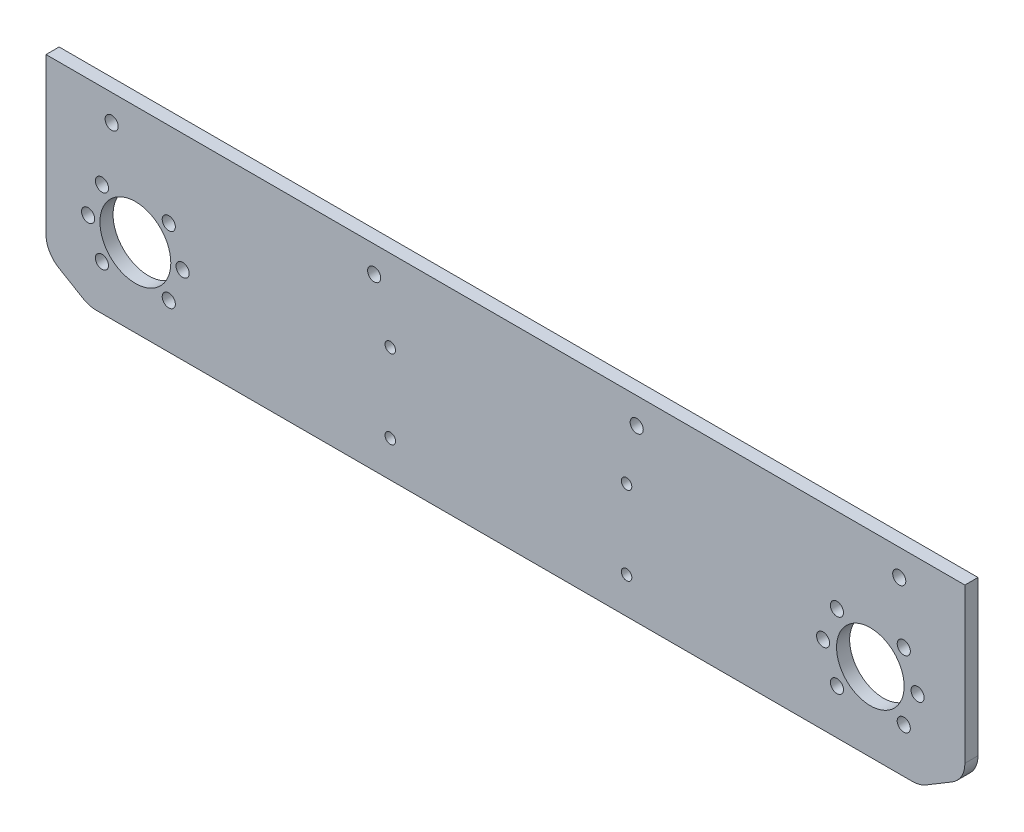
ISO-10303-21;
HEADER;
FILE_DESCRIPTION(('STEP AP214'),'2;1');
FILE_NAME('part.step','',(''),(''),'','','');
FILE_SCHEMA(('AUTOMOTIVE_DESIGN { 1 0 10303 214 1 1 1 1 }'));
ENDSEC;
DATA;
#1=APPLICATION_CONTEXT('core data for automotive mechanical design processes');
#2=APPLICATION_PROTOCOL_DEFINITION('international standard','automotive_design',2000,#1);
#3=PRODUCT_CONTEXT('',#1,'mechanical');
#4=PRODUCT('Part','Part','',(#3));
#5=PRODUCT_RELATED_PRODUCT_CATEGORY('part','',(#4));
#6=PRODUCT_DEFINITION_FORMATION('','',#4);
#7=PRODUCT_DEFINITION_CONTEXT('part definition',#1,'design');
#8=PRODUCT_DEFINITION('design','',#6,#7);
#9=PRODUCT_DEFINITION_SHAPE('','',#8);
#10=(LENGTH_UNIT() NAMED_UNIT(*) SI_UNIT(.MILLI.,.METRE.));
#11=(NAMED_UNIT(*) PLANE_ANGLE_UNIT() SI_UNIT($,.RADIAN.));
#12=(NAMED_UNIT(*) SI_UNIT($,.STERADIAN.) SOLID_ANGLE_UNIT());
#13=UNCERTAINTY_MEASURE_WITH_UNIT(LENGTH_MEASURE(1.E-05),#10,'distance_accuracy_value','');
#14=(GEOMETRIC_REPRESENTATION_CONTEXT(3) GLOBAL_UNCERTAINTY_ASSIGNED_CONTEXT((#13)) GLOBAL_UNIT_ASSIGNED_CONTEXT((#10,
#11,#12)) REPRESENTATION_CONTEXT('',''));
#15=CARTESIAN_POINT('',(0.,0.,0.));
#16=DIRECTION('',(0.,0.,1.));
#17=DIRECTION('',(1.,0.,0.));
#18=AXIS2_PLACEMENT_3D('',#15,#16,#17);
#19=CARTESIAN_POINT('',(-167.402767174734,-12.7734326703558,5.));
#20=DIRECTION('',(0.,0.,-1.));
#21=DIRECTION('',(-1.,0.,0.));
#22=AXIS2_PLACEMENT_3D('',#19,#20,#21);
#23=PLANE('',#22);
#24=DIRECTION('',(0.,1.,0.));
#25=VECTOR('',#24,1.);
#26=CARTESIAN_POINT('',(172.597232825266,-12.2122551122481,5.));
#27=LINE('',#26,#25);
#28=CARTESIAN_POINT('',(172.597232825266,-12.2122551122481,5.));
#29=VERTEX_POINT('',#28);
#30=CARTESIAN_POINT('',(172.597232825266,46.5972328252662,5.));
#31=VERTEX_POINT('',#30);
#32=EDGE_CURVE('E98',#29,#31,#27,.T.);
#33=ORIENTED_EDGE('',*,*,#32,.T.);
#34=DIRECTION('',(-1.,0.,0.));
#35=VECTOR('',#34,1.);
#36=CARTESIAN_POINT('',(-177.402767174734,46.5972328252662,5.));
#37=LINE('',#36,#35);
#38=CARTESIAN_POINT('',(-177.402767174734,46.5972328252662,5.));
#39=VERTEX_POINT('',#38);
#40=EDGE_CURVE('E186',#31,#39,#37,.T.);
#41=ORIENTED_EDGE('',*,*,#40,.T.);
#42=DIRECTION('',(0.,-1.,0.));
#43=VECTOR('',#42,1.);
#44=CARTESIAN_POINT('',(-177.402767174734,46.5972328252662,5.));
#45=LINE('',#44,#43);
#46=CARTESIAN_POINT('',(-177.402767174734,-12.7734326703558,5.));
#47=VERTEX_POINT('',#46);
#48=EDGE_CURVE('E182',#39,#47,#45,.T.);
#49=ORIENTED_EDGE('',*,*,#48,.T.);
#50=CARTESIAN_POINT('',(-167.402767174734,-12.7734326703558,5.));
#51=DIRECTION('',(0.,0.,1.));
#52=DIRECTION('',(-1.,0.,0.));
#53=AXIS2_PLACEMENT_3D('',#50,#51,#52);
#54=CIRCLE('',#53,10.);
#55=CARTESIAN_POINT('',(-172.485413259546,-21.3854422370334,5.));
#56=VERTEX_POINT('',#55);
#57=EDGE_CURVE('E203',#47,#56,#54,.T.);
#58=ORIENTED_EDGE('',*,*,#57,.T.);
#59=DIRECTION('',(0.861200956667754,-0.508264608481198,0.));
#60=VECTOR('',#59,1.);
#61=CARTESIAN_POINT('',(-172.485413259546,-21.3854422370334,5.));
#62=LINE('',#61,#60);
#63=CARTESIAN_POINT('',(-163.287395186087,-26.8139395218003,5.));
#64=VERTEX_POINT('',#63);
#65=EDGE_CURVE('E200',#56,#64,#62,.T.);
#66=ORIENTED_EDGE('',*,*,#65,.T.);
#67=CARTESIAN_POINT('',(-158.204749101275,-18.2019299551227,5.));
#68=DIRECTION('',(0.,0.,1.));
#69=DIRECTION('',(1.,0.,0.));
#70=AXIS2_PLACEMENT_3D('',#67,#68,#69);
#71=CIRCLE('',#70,10.);
#72=CARTESIAN_POINT('',(-158.204749101275,-28.2019299551228,5.));
#73=VERTEX_POINT('',#72);
#74=EDGE_CURVE('E202',#64,#73,#71,.T.);
#75=ORIENTED_EDGE('',*,*,#74,.T.);
#76=DIRECTION('',(1.,0.,0.));
#77=VECTOR('',#76,1.);
#78=CARTESIAN_POINT('',(-158.204749101275,-28.2019299551227,5.));
#79=LINE('',#78,#77);
#80=CARTESIAN_POINT('',(152.619810176667,-28.2019299551227,5.));
#81=VERTEX_POINT('',#80);
#82=EDGE_CURVE('E124',#73,#81,#79,.T.);
#83=ORIENTED_EDGE('',*,*,#82,.T.);
#84=CARTESIAN_POINT('',(152.619810176667,-18.2019299551227,5.));
#85=DIRECTION('',(0.,0.,1.));
#86=DIRECTION('',(-1.,0.,0.));
#87=AXIS2_PLACEMENT_3D('',#84,#85,#86);
#88=CIRCLE('',#87,10.);
#89=CARTESIAN_POINT('',(157.766802923038,-26.775637768479,5.));
#90=VERTEX_POINT('',#89);
#91=EDGE_CURVE('E118',#81,#90,#88,.T.);
#92=ORIENTED_EDGE('',*,*,#91,.T.);
#93=DIRECTION('',(0.857370781335623,0.514699274637087,0.));
#94=VECTOR('',#93,1.);
#95=CARTESIAN_POINT('',(157.766802923038,-26.775637768479,5.));
#96=LINE('',#95,#94);
#97=CARTESIAN_POINT('',(167.744225571637,-20.7859629256043,5.));
#98=VERTEX_POINT('',#97);
#99=EDGE_CURVE('E122',#90,#98,#96,.T.);
#100=ORIENTED_EDGE('',*,*,#99,.T.);
#101=CARTESIAN_POINT('',(162.597232825266,-12.2122551122481,5.));
#102=DIRECTION('',(0.,0.,1.));
#103=DIRECTION('',(1.,0.,0.));
#104=AXIS2_PLACEMENT_3D('',#101,#102,#103);
#105=CIRCLE('',#104,10.);
#106=EDGE_CURVE('E50',#98,#29,#105,.T.);
#107=ORIENTED_EDGE('',*,*,#106,.T.);
#108=EDGE_LOOP('',(#33,#41,#49,#58,#66,#75,#83,#92,#100,#107));
#109=FACE_BOUND('',#108,.T.);
#110=CARTESIAN_POINT('',(-46.2689939647074,15.5907548810993,5.));
#111=DIRECTION('',(0.,0.,1.));
#112=DIRECTION('',(1.,0.,0.));
#113=AXIS2_PLACEMENT_3D('',#110,#111,#112);
#114=CIRCLE('',#113,2.00000000000001);
#115=CARTESIAN_POINT('',(-44.2689939647074,15.5907548810993,5.));
#116=VERTEX_POINT('',#115);
#117=EDGE_CURVE('E144',#116,#116,#114,.T.);
#118=ORIENTED_EDGE('',*,*,#117,.F.);
#119=EDGE_LOOP('',(#118));
#120=FACE_BOUND('',#119,.T.);
#121=CARTESIAN_POINT('',(118.590211239185,1.63605856800766,5.));
#122=DIRECTION('',(0.,0.,1.));
#123=DIRECTION('',(1.,0.,0.));
#124=AXIS2_PLACEMENT_3D('',#121,#122,#123);
#125=CIRCLE('',#124,2.5);
#126=CARTESIAN_POINT('',(121.090211239185,1.63605856800766,5.));
#127=VERTEX_POINT('',#126);
#128=EDGE_CURVE('E214',#127,#127,#125,.T.);
#129=ORIENTED_EDGE('',*,*,#128,.F.);
#130=EDGE_LOOP('',(#129));
#131=FACE_BOUND('',#130,.T.);
#132=CARTESIAN_POINT('',(154.590211239185,1.63605856800766,5.));
#133=DIRECTION('',(0.,0.,1.));
#134=DIRECTION('',(1.,0.,0.));
#135=AXIS2_PLACEMENT_3D('',#132,#133,#134);
#136=CIRCLE('',#135,2.5);
#137=CARTESIAN_POINT('',(157.090211239185,1.63605856800766,5.));
#138=VERTEX_POINT('',#137);
#139=EDGE_CURVE('E220',#138,#138,#136,.T.);
#140=ORIENTED_EDGE('',*,*,#139,.F.);
#141=EDGE_LOOP('',(#140));
#142=FACE_BOUND('',#141,.T.);
#143=CARTESIAN_POINT('',(136.590211239185,1.63605856800766,5.));
#144=DIRECTION('',(0.,0.,1.));
#145=DIRECTION('',(1.,0.,0.));
#146=AXIS2_PLACEMENT_3D('',#143,#144,#145);
#147=CIRCLE('',#146,12.875);
#148=CARTESIAN_POINT('',(149.465211239185,1.63605856800766,5.));
#149=VERTEX_POINT('',#148);
#150=EDGE_CURVE('E226',#149,#149,#147,.T.);
#151=ORIENTED_EDGE('',*,*,#150,.F.);
#152=EDGE_LOOP('',(#151));
#153=FACE_BOUND('',#152,.T.);
#154=CARTESIAN_POINT('',(-143.364629919046,1.61614445701794,5.));
#155=DIRECTION('',(0.,0.,1.));
#156=DIRECTION('',(1.,0.,0.));
#157=AXIS2_PLACEMENT_3D('',#154,#155,#156);
#158=CIRCLE('',#157,13.5);
#159=CARTESIAN_POINT('',(-129.864629919046,1.61614445701794,5.));
#160=VERTEX_POINT('',#159);
#161=EDGE_CURVE('E232',#160,#160,#158,.T.);
#162=ORIENTED_EDGE('',*,*,#161,.F.);
#163=EDGE_LOOP('',(#162));
#164=FACE_BOUND('',#163,.T.);
#165=CARTESIAN_POINT('',(-130.636707857688,14.3440665183758,5.));
#166=DIRECTION('',(0.,0.,1.));
#167=DIRECTION('',(1.,0.,0.));
#168=AXIS2_PLACEMENT_3D('',#165,#166,#167);
#169=CIRCLE('',#168,2.5);
#170=CARTESIAN_POINT('',(-128.136707857688,14.3440665183758,5.));
#171=VERTEX_POINT('',#170);
#172=EDGE_CURVE('E238',#171,#171,#169,.T.);
#173=ORIENTED_EDGE('',*,*,#172,.F.);
#174=EDGE_LOOP('',(#173));
#175=FACE_BOUND('',#174,.T.);
#176=CARTESIAN_POINT('',(-156.092551980404,14.3440665183758,5.));
#177=DIRECTION('',(0.,0.,1.));
#178=DIRECTION('',(-1.,0.,0.));
#179=AXIS2_PLACEMENT_3D('',#176,#177,#178);
#180=CIRCLE('',#179,2.5);
#181=CARTESIAN_POINT('',(-158.592551980404,14.3440665183758,5.));
#182=VERTEX_POINT('',#181);
#183=EDGE_CURVE('E244',#182,#182,#180,.T.);
#184=ORIENTED_EDGE('',*,*,#183,.F.);
#185=EDGE_LOOP('',(#184));
#186=FACE_BOUND('',#185,.T.);
#187=CARTESIAN_POINT('',(-130.636707857688,-11.1117776043399,5.));
#188=DIRECTION('',(0.,0.,1.));
#189=DIRECTION('',(-1.,0.,0.));
#190=AXIS2_PLACEMENT_3D('',#187,#188,#189);
#191=CIRCLE('',#190,2.5);
#192=CARTESIAN_POINT('',(-133.136707857688,-11.1117776043399,5.));
#193=VERTEX_POINT('',#192);
#194=EDGE_CURVE('E250',#193,#193,#191,.T.);
#195=ORIENTED_EDGE('',*,*,#194,.F.);
#196=EDGE_LOOP('',(#195));
#197=FACE_BOUND('',#196,.T.);
#198=CARTESIAN_POINT('',(-156.092551980404,-11.1117776043399,5.));
#199=DIRECTION('',(0.,0.,1.));
#200=DIRECTION('',(1.,0.,0.));
#201=AXIS2_PLACEMENT_3D('',#198,#199,#200);
#202=CIRCLE('',#201,2.5);
#203=CARTESIAN_POINT('',(-153.592551980404,-11.1117776043399,5.));
#204=VERTEX_POINT('',#203);
#205=EDGE_CURVE('E256',#204,#204,#202,.T.);
#206=ORIENTED_EDGE('',*,*,#205,.F.);
#207=EDGE_LOOP('',(#206));
#208=FACE_BOUND('',#207,.T.);
#209=CARTESIAN_POINT('',(-46.2689939647074,-14.4092451189008,5.));
#210=DIRECTION('',(0.,0.,1.));
#211=DIRECTION('',(1.,0.,0.));
#212=AXIS2_PLACEMENT_3D('',#209,#210,#211);
#213=CIRCLE('',#212,2.00000000000001);
#214=CARTESIAN_POINT('',(-44.2689939647074,-14.4092451189008,5.));
#215=VERTEX_POINT('',#214);
#216=EDGE_CURVE('E262',#215,#215,#213,.T.);
#217=ORIENTED_EDGE('',*,*,#216,.F.);
#218=EDGE_LOOP('',(#217));
#219=FACE_BOUND('',#218,.T.);
#220=CARTESIAN_POINT('',(43.7374372852343,15.5907548810993,5.));
#221=DIRECTION('',(0.,0.,1.));
#222=DIRECTION('',(1.,0.,0.));
#223=AXIS2_PLACEMENT_3D('',#220,#221,#222);
#224=CIRCLE('',#223,2.);
#225=CARTESIAN_POINT('',(45.7374372852343,15.5907548810993,5.));
#226=VERTEX_POINT('',#225);
#227=EDGE_CURVE('E268',#226,#226,#224,.T.);
#228=ORIENTED_EDGE('',*,*,#227,.F.);
#229=EDGE_LOOP('',(#228));
#230=FACE_BOUND('',#229,.T.);
#231=CARTESIAN_POINT('',(43.7374372852343,-14.4092451189008,5.));
#232=DIRECTION('',(0.,0.,1.));
#233=DIRECTION('',(1.,0.,0.));
#234=AXIS2_PLACEMENT_3D('',#231,#232,#233);
#235=CIRCLE('',#234,2.);
#236=CARTESIAN_POINT('',(45.7374372852343,-14.4092451189008,5.));
#237=VERTEX_POINT('',#236);
#238=EDGE_CURVE('E274',#237,#237,#235,.T.);
#239=ORIENTED_EDGE('',*,*,#238,.F.);
#240=EDGE_LOOP('',(#239));
#241=FACE_BOUND('',#240,.T.);
#242=CARTESIAN_POINT('',(-152.402767174734,36.5972328252662,5.));
#243=DIRECTION('',(0.,0.,1.));
#244=DIRECTION('',(1.,0.,0.));
#245=AXIS2_PLACEMENT_3D('',#242,#243,#244);
#246=CIRCLE('',#245,2.5);
#247=CARTESIAN_POINT('',(-149.902767174734,36.5972328252662,5.));
#248=VERTEX_POINT('',#247);
#249=EDGE_CURVE('E280',#248,#248,#246,.T.);
#250=ORIENTED_EDGE('',*,*,#249,.F.);
#251=EDGE_LOOP('',(#250));
#252=FACE_BOUND('',#251,.T.);
#253=CARTESIAN_POINT('',(-52.4027671747336,36.5972328252662,5.));
#254=DIRECTION('',(0.,0.,1.));
#255=DIRECTION('',(1.,0.,0.));
#256=AXIS2_PLACEMENT_3D('',#253,#254,#255);
#257=CIRCLE('',#256,2.5);
#258=CARTESIAN_POINT('',(-49.9027671747336,36.5972328252662,5.));
#259=VERTEX_POINT('',#258);
#260=EDGE_CURVE('E286',#259,#259,#257,.T.);
#261=ORIENTED_EDGE('',*,*,#260,.F.);
#262=EDGE_LOOP('',(#261));
#263=FACE_BOUND('',#262,.T.);
#264=CARTESIAN_POINT('',(47.5972328252664,36.5972328252662,5.));
#265=DIRECTION('',(0.,0.,1.));
#266=DIRECTION('',(1.,0.,0.));
#267=AXIS2_PLACEMENT_3D('',#264,#265,#266);
#268=CIRCLE('',#267,2.5);
#269=CARTESIAN_POINT('',(50.0972328252664,36.5972328252662,5.));
#270=VERTEX_POINT('',#269);
#271=EDGE_CURVE('E292',#270,#270,#268,.T.);
#272=ORIENTED_EDGE('',*,*,#271,.F.);
#273=EDGE_LOOP('',(#272));
#274=FACE_BOUND('',#273,.T.);
#275=CARTESIAN_POINT('',(147.597232825266,36.5972328252662,5.));
#276=DIRECTION('',(0.,0.,1.));
#277=DIRECTION('',(1.,0.,0.));
#278=AXIS2_PLACEMENT_3D('',#275,#276,#277);
#279=CIRCLE('',#278,2.5);
#280=CARTESIAN_POINT('',(150.097232825266,36.5972328252662,5.));
#281=VERTEX_POINT('',#280);
#282=EDGE_CURVE('E298',#281,#281,#279,.T.);
#283=ORIENTED_EDGE('',*,*,#282,.F.);
#284=EDGE_LOOP('',(#283));
#285=FACE_BOUND('',#284,.T.);
#286=CARTESIAN_POINT('',(-161.364629919046,1.61614445701794,5.));
#287=DIRECTION('',(0.,0.,1.));
#288=DIRECTION('',(1.,0.,0.));
#289=AXIS2_PLACEMENT_3D('',#286,#287,#288);
#290=CIRCLE('',#289,2.5);
#291=CARTESIAN_POINT('',(-158.864629919046,1.61614445701794,5.));
#292=VERTEX_POINT('',#291);
#293=EDGE_CURVE('E304',#292,#292,#290,.T.);
#294=ORIENTED_EDGE('',*,*,#293,.F.);
#295=EDGE_LOOP('',(#294));
#296=FACE_BOUND('',#295,.T.);
#297=CARTESIAN_POINT('',(-125.364629919046,1.61614445701794,5.));
#298=DIRECTION('',(0.,0.,1.));
#299=DIRECTION('',(-1.,0.,0.));
#300=AXIS2_PLACEMENT_3D('',#297,#298,#299);
#301=CIRCLE('',#300,2.5);
#302=CARTESIAN_POINT('',(-127.864629919046,1.61614445701794,5.));
#303=VERTEX_POINT('',#302);
#304=EDGE_CURVE('E310',#303,#303,#301,.T.);
#305=ORIENTED_EDGE('',*,*,#304,.F.);
#306=EDGE_LOOP('',(#305));
#307=FACE_BOUND('',#306,.T.);
#308=CARTESIAN_POINT('',(149.318133300543,-11.0918634933502,5.));
#309=DIRECTION('',(0.,0.,1.));
#310=DIRECTION('',(-1.,0.,0.));
#311=AXIS2_PLACEMENT_3D('',#308,#309,#310);
#312=CIRCLE('',#311,2.5);
#313=CARTESIAN_POINT('',(146.818133300543,-11.0918634933502,5.));
#314=VERTEX_POINT('',#313);
#315=EDGE_CURVE('E316',#314,#314,#312,.T.);
#316=ORIENTED_EDGE('',*,*,#315,.F.);
#317=EDGE_LOOP('',(#316));
#318=FACE_BOUND('',#317,.T.);
#319=CARTESIAN_POINT('',(123.862289177827,-11.0918634933502,5.));
#320=DIRECTION('',(0.,0.,1.));
#321=DIRECTION('',(1.,0.,0.));
#322=AXIS2_PLACEMENT_3D('',#319,#320,#321);
#323=CIRCLE('',#322,2.5);
#324=CARTESIAN_POINT('',(126.362289177827,-11.0918634933502,5.));
#325=VERTEX_POINT('',#324);
#326=EDGE_CURVE('E322',#325,#325,#323,.T.);
#327=ORIENTED_EDGE('',*,*,#326,.F.);
#328=EDGE_LOOP('',(#327));
#329=FACE_BOUND('',#328,.T.);
#330=CARTESIAN_POINT('',(123.862289177827,14.3639806293655,5.));
#331=DIRECTION('',(0.,0.,1.));
#332=DIRECTION('',(-1.,0.,0.));
#333=AXIS2_PLACEMENT_3D('',#330,#331,#332);
#334=CIRCLE('',#333,2.5);
#335=CARTESIAN_POINT('',(121.362289177827,14.3639806293655,5.));
#336=VERTEX_POINT('',#335);
#337=EDGE_CURVE('E328',#336,#336,#334,.T.);
#338=ORIENTED_EDGE('',*,*,#337,.F.);
#339=EDGE_LOOP('',(#338));
#340=FACE_BOUND('',#339,.T.);
#341=CARTESIAN_POINT('',(149.318133300543,14.3639806293655,5.));
#342=DIRECTION('',(0.,0.,1.));
#343=DIRECTION('',(1.,0.,0.));
#344=AXIS2_PLACEMENT_3D('',#341,#342,#343);
#345=CIRCLE('',#344,2.5);
#346=CARTESIAN_POINT('',(151.818133300543,14.3639806293655,5.));
#347=VERTEX_POINT('',#346);
#348=EDGE_CURVE('E334',#347,#347,#345,.T.);
#349=ORIENTED_EDGE('',*,*,#348,.F.);
#350=EDGE_LOOP('',(#349));
#351=FACE_BOUND('',#350,.T.);
#352=ADVANCED_FACE('F33',(#109,#120,#131,#142,#153,#164,#175,#186,#197,#208,#219,#230,#241,#252,
#263,#274,#285,#296,#307,#318,#329,#340,#351),#23,.F.);
#353=CARTESIAN_POINT('',(-167.402767174734,-12.7734326703558,0.));
#354=DIRECTION('',(0.,0.,-1.));
#355=DIRECTION('',(-1.,0.,0.));
#356=AXIS2_PLACEMENT_3D('',#353,#354,#355);
#357=PLANE('',#356);
#358=CARTESIAN_POINT('',(123.862289177827,14.3639806293655,0.));
#359=DIRECTION('',(0.,0.,1.));
#360=DIRECTION('',(-1.,0.,0.));
#361=AXIS2_PLACEMENT_3D('',#358,#359,#360);
#362=CIRCLE('',#361,2.5);
#363=CARTESIAN_POINT('',(121.362289177827,14.3639806293655,0.));
#364=VERTEX_POINT('',#363);
#365=EDGE_CURVE('E331',#364,#364,#362,.T.);
#366=ORIENTED_EDGE('',*,*,#365,.T.);
#367=EDGE_LOOP('',(#366));
#368=FACE_BOUND('',#367,.T.);
#369=CARTESIAN_POINT('',(149.318133300543,-11.0918634933502,0.));
#370=DIRECTION('',(0.,0.,1.));
#371=DIRECTION('',(-1.,0.,0.));
#372=AXIS2_PLACEMENT_3D('',#369,#370,#371);
#373=CIRCLE('',#372,2.5);
#374=CARTESIAN_POINT('',(146.818133300543,-11.0918634933502,0.));
#375=VERTEX_POINT('',#374);
#376=EDGE_CURVE('E319',#375,#375,#373,.T.);
#377=ORIENTED_EDGE('',*,*,#376,.T.);
#378=EDGE_LOOP('',(#377));
#379=FACE_BOUND('',#378,.T.);
#380=CARTESIAN_POINT('',(-161.364629919046,1.61614445701794,0.));
#381=DIRECTION('',(0.,0.,1.));
#382=DIRECTION('',(1.,0.,0.));
#383=AXIS2_PLACEMENT_3D('',#380,#381,#382);
#384=CIRCLE('',#383,2.5);
#385=CARTESIAN_POINT('',(-158.864629919046,1.61614445701794,0.));
#386=VERTEX_POINT('',#385);
#387=EDGE_CURVE('E307',#386,#386,#384,.T.);
#388=ORIENTED_EDGE('',*,*,#387,.T.);
#389=EDGE_LOOP('',(#388));
#390=FACE_BOUND('',#389,.T.);
#391=CARTESIAN_POINT('',(47.5972328252664,36.5972328252662,0.));
#392=DIRECTION('',(0.,0.,1.));
#393=DIRECTION('',(1.,0.,0.));
#394=AXIS2_PLACEMENT_3D('',#391,#392,#393);
#395=CIRCLE('',#394,2.5);
#396=CARTESIAN_POINT('',(50.0972328252664,36.5972328252662,0.));
#397=VERTEX_POINT('',#396);
#398=EDGE_CURVE('E295',#397,#397,#395,.T.);
#399=ORIENTED_EDGE('',*,*,#398,.T.);
#400=EDGE_LOOP('',(#399));
#401=FACE_BOUND('',#400,.T.);
#402=CARTESIAN_POINT('',(-152.402767174734,36.5972328252662,0.));
#403=DIRECTION('',(0.,0.,1.));
#404=DIRECTION('',(1.,0.,0.));
#405=AXIS2_PLACEMENT_3D('',#402,#403,#404);
#406=CIRCLE('',#405,2.5);
#407=CARTESIAN_POINT('',(-149.902767174734,36.5972328252662,0.));
#408=VERTEX_POINT('',#407);
#409=EDGE_CURVE('E283',#408,#408,#406,.T.);
#410=ORIENTED_EDGE('',*,*,#409,.T.);
#411=EDGE_LOOP('',(#410));
#412=FACE_BOUND('',#411,.T.);
#413=CARTESIAN_POINT('',(43.7374372852343,15.5907548810993,0.));
#414=DIRECTION('',(0.,0.,1.));
#415=DIRECTION('',(1.,0.,0.));
#416=AXIS2_PLACEMENT_3D('',#413,#414,#415);
#417=CIRCLE('',#416,2.);
#418=CARTESIAN_POINT('',(45.7374372852343,15.5907548810993,0.));
#419=VERTEX_POINT('',#418);
#420=EDGE_CURVE('E271',#419,#419,#417,.T.);
#421=ORIENTED_EDGE('',*,*,#420,.T.);
#422=EDGE_LOOP('',(#421));
#423=FACE_BOUND('',#422,.T.);
#424=CARTESIAN_POINT('',(-156.092551980404,-11.1117776043399,0.));
#425=DIRECTION('',(0.,0.,1.));
#426=DIRECTION('',(1.,0.,0.));
#427=AXIS2_PLACEMENT_3D('',#424,#425,#426);
#428=CIRCLE('',#427,2.5);
#429=CARTESIAN_POINT('',(-153.592551980404,-11.1117776043399,0.));
#430=VERTEX_POINT('',#429);
#431=EDGE_CURVE('E259',#430,#430,#428,.T.);
#432=ORIENTED_EDGE('',*,*,#431,.T.);
#433=EDGE_LOOP('',(#432));
#434=FACE_BOUND('',#433,.T.);
#435=CARTESIAN_POINT('',(-156.092551980404,14.3440665183758,0.));
#436=DIRECTION('',(0.,0.,1.));
#437=DIRECTION('',(-1.,0.,0.));
#438=AXIS2_PLACEMENT_3D('',#435,#436,#437);
#439=CIRCLE('',#438,2.5);
#440=CARTESIAN_POINT('',(-158.592551980404,14.3440665183758,0.));
#441=VERTEX_POINT('',#440);
#442=EDGE_CURVE('E247',#441,#441,#439,.T.);
#443=ORIENTED_EDGE('',*,*,#442,.T.);
#444=EDGE_LOOP('',(#443));
#445=FACE_BOUND('',#444,.T.);
#446=CARTESIAN_POINT('',(-143.364629919046,1.61614445701794,0.));
#447=DIRECTION('',(0.,0.,1.));
#448=DIRECTION('',(1.,0.,0.));
#449=AXIS2_PLACEMENT_3D('',#446,#447,#448);
#450=CIRCLE('',#449,13.5);
#451=CARTESIAN_POINT('',(-129.864629919046,1.61614445701794,0.));
#452=VERTEX_POINT('',#451);
#453=EDGE_CURVE('E235',#452,#452,#450,.T.);
#454=ORIENTED_EDGE('',*,*,#453,.T.);
#455=EDGE_LOOP('',(#454));
#456=FACE_BOUND('',#455,.T.);
#457=CARTESIAN_POINT('',(154.590211239185,1.63605856800766,0.));
#458=DIRECTION('',(0.,0.,1.));
#459=DIRECTION('',(1.,0.,0.));
#460=AXIS2_PLACEMENT_3D('',#457,#458,#459);
#461=CIRCLE('',#460,2.5);
#462=CARTESIAN_POINT('',(157.090211239185,1.63605856800766,0.));
#463=VERTEX_POINT('',#462);
#464=EDGE_CURVE('E223',#463,#463,#461,.T.);
#465=ORIENTED_EDGE('',*,*,#464,.T.);
#466=EDGE_LOOP('',(#465));
#467=FACE_BOUND('',#466,.T.);
#468=CARTESIAN_POINT('',(-46.2689939647074,15.5907548810993,0.));
#469=DIRECTION('',(0.,0.,1.));
#470=DIRECTION('',(1.,0.,0.));
#471=AXIS2_PLACEMENT_3D('',#468,#469,#470);
#472=CIRCLE('',#471,2.00000000000001);
#473=CARTESIAN_POINT('',(-44.2689939647074,15.5907548810993,0.));
#474=VERTEX_POINT('',#473);
#475=EDGE_CURVE('E211',#474,#474,#472,.T.);
#476=ORIENTED_EDGE('',*,*,#475,.T.);
#477=EDGE_LOOP('',(#476));
#478=FACE_BOUND('',#477,.T.);
#479=DIRECTION('',(0.,1.,0.));
#480=VECTOR('',#479,1.);
#481=CARTESIAN_POINT('',(172.597232825266,46.5972328252662,0.));
#482=LINE('',#481,#480);
#483=CARTESIAN_POINT('',(172.597232825266,-12.2122551122481,0.));
#484=VERTEX_POINT('',#483);
#485=CARTESIAN_POINT('',(172.597232825266,46.5972328252662,0.));
#486=VERTEX_POINT('',#485);
#487=EDGE_CURVE('E92',#484,#486,#482,.T.);
#488=ORIENTED_EDGE('',*,*,#487,.F.);
#489=CARTESIAN_POINT('',(162.597232825266,-12.2122551122481,0.));
#490=DIRECTION('',(0.,0.,1.));
#491=DIRECTION('',(1.,0.,0.));
#492=AXIS2_PLACEMENT_3D('',#489,#490,#491);
#493=CIRCLE('',#492,10.);
#494=CARTESIAN_POINT('',(167.744225571637,-20.7859629256043,0.));
#495=VERTEX_POINT('',#494);
#496=EDGE_CURVE('E159',#495,#484,#493,.T.);
#497=ORIENTED_EDGE('',*,*,#496,.F.);
#498=DIRECTION('',(0.857370781335623,0.514699274637087,0.));
#499=VECTOR('',#498,1.);
#500=CARTESIAN_POINT('',(157.766802923038,-26.775637768479,0.));
#501=LINE('',#500,#499);
#502=CARTESIAN_POINT('',(157.766802923038,-26.775637768479,0.));
#503=VERTEX_POINT('',#502);
#504=EDGE_CURVE('E85',#503,#495,#501,.T.);
#505=ORIENTED_EDGE('',*,*,#504,.F.);
#506=CARTESIAN_POINT('',(152.619810176667,-18.2019299551227,0.));
#507=DIRECTION('',(0.,0.,1.));
#508=DIRECTION('',(-1.,0.,0.));
#509=AXIS2_PLACEMENT_3D('',#506,#507,#508);
#510=CIRCLE('',#509,10.);
#511=CARTESIAN_POINT('',(152.619810176667,-28.2019299551227,0.));
#512=VERTEX_POINT('',#511);
#513=EDGE_CURVE('E132',#512,#503,#510,.T.);
#514=ORIENTED_EDGE('',*,*,#513,.F.);
#515=DIRECTION('',(1.,0.,0.));
#516=VECTOR('',#515,1.);
#517=CARTESIAN_POINT('',(-158.204749101275,-28.2019299551227,0.));
#518=LINE('',#517,#516);
#519=CARTESIAN_POINT('',(-158.204749101275,-28.2019299551228,0.));
#520=VERTEX_POINT('',#519);
#521=EDGE_CURVE('E155',#520,#512,#518,.T.);
#522=ORIENTED_EDGE('',*,*,#521,.F.);
#523=CARTESIAN_POINT('',(-158.204749101275,-18.2019299551227,0.));
#524=DIRECTION('',(0.,0.,1.));
#525=DIRECTION('',(1.,0.,0.));
#526=AXIS2_PLACEMENT_3D('',#523,#524,#525);
#527=CIRCLE('',#526,10.);
#528=CARTESIAN_POINT('',(-163.287395186087,-26.8139395218003,0.));
#529=VERTEX_POINT('',#528);
#530=EDGE_CURVE('E153',#529,#520,#527,.T.);
#531=ORIENTED_EDGE('',*,*,#530,.F.);
#532=DIRECTION('',(0.861200956667754,-0.508264608481198,0.));
#533=VECTOR('',#532,1.);
#534=CARTESIAN_POINT('',(-172.485413259546,-21.3854422370334,0.));
#535=LINE('',#534,#533);
#536=CARTESIAN_POINT('',(-172.485413259546,-21.3854422370334,0.));
#537=VERTEX_POINT('',#536);
#538=EDGE_CURVE('E151',#537,#529,#535,.T.);
#539=ORIENTED_EDGE('',*,*,#538,.F.);
#540=CARTESIAN_POINT('',(-167.402767174734,-12.7734326703558,0.));
#541=DIRECTION('',(0.,0.,1.));
#542=DIRECTION('',(-1.,0.,0.));
#543=AXIS2_PLACEMENT_3D('',#540,#541,#542);
#544=CIRCLE('',#543,10.);
#545=CARTESIAN_POINT('',(-177.402767174734,-12.7734326703558,0.));
#546=VERTEX_POINT('',#545);
#547=EDGE_CURVE('E149',#546,#537,#544,.T.);
#548=ORIENTED_EDGE('',*,*,#547,.F.);
#549=DIRECTION('',(0.,-1.,0.));
#550=VECTOR('',#549,1.);
#551=CARTESIAN_POINT('',(-177.402767174734,-10.3076505936154,0.));
#552=LINE('',#551,#550);
#553=CARTESIAN_POINT('',(-177.402767174734,46.5972328252662,0.));
#554=VERTEX_POINT('',#553);
#555=EDGE_CURVE('E147',#554,#546,#552,.T.);
#556=ORIENTED_EDGE('',*,*,#555,.F.);
#557=DIRECTION('',(-1.,0.,0.));
#558=VECTOR('',#557,1.);
#559=CARTESIAN_POINT('',(-177.402767174734,46.5972328252662,0.));
#560=LINE('',#559,#558);
#561=EDGE_CURVE('E143',#486,#554,#560,.T.);
#562=ORIENTED_EDGE('',*,*,#561,.F.);
#563=EDGE_LOOP('',(#488,#497,#505,#514,#522,#531,#539,#548,#556,#562));
#564=FACE_BOUND('',#563,.T.);
#565=CARTESIAN_POINT('',(118.590211239185,1.63605856800766,0.));
#566=DIRECTION('',(0.,0.,1.));
#567=DIRECTION('',(1.,0.,0.));
#568=AXIS2_PLACEMENT_3D('',#565,#566,#567);
#569=CIRCLE('',#568,2.5);
#570=CARTESIAN_POINT('',(121.090211239185,1.63605856800766,0.));
#571=VERTEX_POINT('',#570);
#572=EDGE_CURVE('E217',#571,#571,#569,.T.);
#573=ORIENTED_EDGE('',*,*,#572,.T.);
#574=EDGE_LOOP('',(#573));
#575=FACE_BOUND('',#574,.T.);
#576=CARTESIAN_POINT('',(136.590211239185,1.63605856800766,0.));
#577=DIRECTION('',(0.,0.,1.));
#578=DIRECTION('',(1.,0.,0.));
#579=AXIS2_PLACEMENT_3D('',#576,#577,#578);
#580=CIRCLE('',#579,12.875);
#581=CARTESIAN_POINT('',(149.465211239185,1.63605856800766,0.));
#582=VERTEX_POINT('',#581);
#583=EDGE_CURVE('E229',#582,#582,#580,.T.);
#584=ORIENTED_EDGE('',*,*,#583,.T.);
#585=EDGE_LOOP('',(#584));
#586=FACE_BOUND('',#585,.T.);
#587=CARTESIAN_POINT('',(-130.636707857688,14.3440665183758,0.));
#588=DIRECTION('',(0.,0.,1.));
#589=DIRECTION('',(1.,0.,0.));
#590=AXIS2_PLACEMENT_3D('',#587,#588,#589);
#591=CIRCLE('',#590,2.5);
#592=CARTESIAN_POINT('',(-128.136707857688,14.3440665183758,0.));
#593=VERTEX_POINT('',#592);
#594=EDGE_CURVE('E241',#593,#593,#591,.T.);
#595=ORIENTED_EDGE('',*,*,#594,.T.);
#596=EDGE_LOOP('',(#595));
#597=FACE_BOUND('',#596,.T.);
#598=CARTESIAN_POINT('',(-130.636707857688,-11.1117776043399,0.));
#599=DIRECTION('',(0.,0.,1.));
#600=DIRECTION('',(-1.,0.,0.));
#601=AXIS2_PLACEMENT_3D('',#598,#599,#600);
#602=CIRCLE('',#601,2.5);
#603=CARTESIAN_POINT('',(-133.136707857688,-11.1117776043399,0.));
#604=VERTEX_POINT('',#603);
#605=EDGE_CURVE('E253',#604,#604,#602,.T.);
#606=ORIENTED_EDGE('',*,*,#605,.T.);
#607=EDGE_LOOP('',(#606));
#608=FACE_BOUND('',#607,.T.);
#609=CARTESIAN_POINT('',(-46.2689939647074,-14.4092451189008,0.));
#610=DIRECTION('',(0.,0.,1.));
#611=DIRECTION('',(1.,0.,0.));
#612=AXIS2_PLACEMENT_3D('',#609,#610,#611);
#613=CIRCLE('',#612,2.00000000000001);
#614=CARTESIAN_POINT('',(-44.2689939647074,-14.4092451189008,0.));
#615=VERTEX_POINT('',#614);
#616=EDGE_CURVE('E265',#615,#615,#613,.T.);
#617=ORIENTED_EDGE('',*,*,#616,.T.);
#618=EDGE_LOOP('',(#617));
#619=FACE_BOUND('',#618,.T.);
#620=CARTESIAN_POINT('',(43.7374372852343,-14.4092451189008,0.));
#621=DIRECTION('',(0.,0.,1.));
#622=DIRECTION('',(1.,0.,0.));
#623=AXIS2_PLACEMENT_3D('',#620,#621,#622);
#624=CIRCLE('',#623,2.);
#625=CARTESIAN_POINT('',(45.7374372852343,-14.4092451189008,0.));
#626=VERTEX_POINT('',#625);
#627=EDGE_CURVE('E277',#626,#626,#624,.T.);
#628=ORIENTED_EDGE('',*,*,#627,.T.);
#629=EDGE_LOOP('',(#628));
#630=FACE_BOUND('',#629,.T.);
#631=CARTESIAN_POINT('',(-52.4027671747336,36.5972328252662,0.));
#632=DIRECTION('',(0.,0.,1.));
#633=DIRECTION('',(1.,0.,0.));
#634=AXIS2_PLACEMENT_3D('',#631,#632,#633);
#635=CIRCLE('',#634,2.5);
#636=CARTESIAN_POINT('',(-49.9027671747336,36.5972328252662,0.));
#637=VERTEX_POINT('',#636);
#638=EDGE_CURVE('E289',#637,#637,#635,.T.);
#639=ORIENTED_EDGE('',*,*,#638,.T.);
#640=EDGE_LOOP('',(#639));
#641=FACE_BOUND('',#640,.T.);
#642=CARTESIAN_POINT('',(147.597232825266,36.5972328252662,0.));
#643=DIRECTION('',(0.,0.,1.));
#644=DIRECTION('',(1.,0.,0.));
#645=AXIS2_PLACEMENT_3D('',#642,#643,#644);
#646=CIRCLE('',#645,2.5);
#647=CARTESIAN_POINT('',(150.097232825266,36.5972328252662,0.));
#648=VERTEX_POINT('',#647);
#649=EDGE_CURVE('E301',#648,#648,#646,.T.);
#650=ORIENTED_EDGE('',*,*,#649,.T.);
#651=EDGE_LOOP('',(#650));
#652=FACE_BOUND('',#651,.T.);
#653=CARTESIAN_POINT('',(-125.364629919046,1.61614445701794,0.));
#654=DIRECTION('',(0.,0.,1.));
#655=DIRECTION('',(-1.,0.,0.));
#656=AXIS2_PLACEMENT_3D('',#653,#654,#655);
#657=CIRCLE('',#656,2.5);
#658=CARTESIAN_POINT('',(-127.864629919046,1.61614445701794,0.));
#659=VERTEX_POINT('',#658);
#660=EDGE_CURVE('E313',#659,#659,#657,.T.);
#661=ORIENTED_EDGE('',*,*,#660,.T.);
#662=EDGE_LOOP('',(#661));
#663=FACE_BOUND('',#662,.T.);
#664=CARTESIAN_POINT('',(123.862289177827,-11.0918634933502,0.));
#665=DIRECTION('',(0.,0.,1.));
#666=DIRECTION('',(1.,0.,0.));
#667=AXIS2_PLACEMENT_3D('',#664,#665,#666);
#668=CIRCLE('',#667,2.5);
#669=CARTESIAN_POINT('',(126.362289177827,-11.0918634933502,0.));
#670=VERTEX_POINT('',#669);
#671=EDGE_CURVE('E325',#670,#670,#668,.T.);
#672=ORIENTED_EDGE('',*,*,#671,.T.);
#673=EDGE_LOOP('',(#672));
#674=FACE_BOUND('',#673,.T.);
#675=CARTESIAN_POINT('',(149.318133300543,14.3639806293655,0.));
#676=DIRECTION('',(0.,0.,1.));
#677=DIRECTION('',(1.,0.,0.));
#678=AXIS2_PLACEMENT_3D('',#675,#676,#677);
#679=CIRCLE('',#678,2.5);
#680=CARTESIAN_POINT('',(151.818133300543,14.3639806293655,0.));
#681=VERTEX_POINT('',#680);
#682=EDGE_CURVE('E337',#681,#681,#679,.T.);
#683=ORIENTED_EDGE('',*,*,#682,.T.);
#684=EDGE_LOOP('',(#683));
#685=FACE_BOUND('',#684,.T.);
#686=ADVANCED_FACE('F187',(#368,#379,#390,#401,#412,#423,#434,#445,#456,#467,#478,#564,#575,
#586,#597,#608,#619,#630,#641,#652,#663,#674,#685),#357,.T.);
#687=CARTESIAN_POINT('',(172.597232825266,46.5972328252662,5.));
#688=DIRECTION('',(-1.,0.,0.));
#689=DIRECTION('',(0.,-1.,0.));
#690=AXIS2_PLACEMENT_3D('',#687,#688,#689);
#691=PLANE('',#690);
#692=ORIENTED_EDGE('',*,*,#487,.T.);
#693=DIRECTION('',(0.,0.,-1.));
#694=VECTOR('',#693,1.);
#695=CARTESIAN_POINT('',(172.597232825266,46.5972328252662,5.));
#696=LINE('',#695,#694);
#697=EDGE_CURVE('E11',#31,#486,#696,.T.);
#698=ORIENTED_EDGE('',*,*,#697,.F.);
#699=ORIENTED_EDGE('',*,*,#32,.F.);
#700=DIRECTION('',(0.,0.,-1.));
#701=VECTOR('',#700,1.);
#702=CARTESIAN_POINT('',(172.597232825266,-12.2122551122481,5.));
#703=LINE('',#702,#701);
#704=EDGE_CURVE('E138',#29,#484,#703,.T.);
#705=ORIENTED_EDGE('',*,*,#704,.T.);
#706=EDGE_LOOP('',(#692,#698,#699,#705));
#707=FACE_BOUND('',#706,.T.);
#708=ADVANCED_FACE('F35',(#707),#691,.F.);
#709=CARTESIAN_POINT('',(-177.402767174734,46.5972328252662,5.));
#710=DIRECTION('',(0.,-1.,0.));
#711=DIRECTION('',(0.,0.,-1.));
#712=AXIS2_PLACEMENT_3D('',#709,#710,#711);
#713=PLANE('',#712);
#714=ORIENTED_EDGE('',*,*,#561,.T.);
#715=DIRECTION('',(0.,0.,-1.));
#716=VECTOR('',#715,1.);
#717=CARTESIAN_POINT('',(-177.402767174734,46.5972328252662,5.));
#718=LINE('',#717,#716);
#719=EDGE_CURVE('E42',#39,#554,#718,.T.);
#720=ORIENTED_EDGE('',*,*,#719,.F.);
#721=ORIENTED_EDGE('',*,*,#40,.F.);
#722=ORIENTED_EDGE('',*,*,#697,.T.);
#723=EDGE_LOOP('',(#714,#720,#721,#722));
#724=FACE_BOUND('',#723,.T.);
#725=ADVANCED_FACE('F185',(#724),#713,.F.);
#726=CARTESIAN_POINT('',(-177.402767174734,-10.3076505936154,5.));
#727=DIRECTION('',(1.,0.,0.));
#728=DIRECTION('',(0.,0.,-1.));
#729=AXIS2_PLACEMENT_3D('',#726,#727,#728);
#730=PLANE('',#729);
#731=ORIENTED_EDGE('',*,*,#555,.T.);
#732=DIRECTION('',(0.,0.,-1.));
#733=VECTOR('',#732,1.);
#734=CARTESIAN_POINT('',(-177.402767174734,-12.7734326703558,5.));
#735=LINE('',#734,#733);
#736=EDGE_CURVE('E174',#47,#546,#735,.T.);
#737=ORIENTED_EDGE('',*,*,#736,.F.);
#738=ORIENTED_EDGE('',*,*,#48,.F.);
#739=ORIENTED_EDGE('',*,*,#719,.T.);
#740=EDGE_LOOP('',(#731,#737,#738,#739));
#741=FACE_BOUND('',#740,.T.);
#742=ADVANCED_FACE('F180',(#741),#730,.F.);
#743=CARTESIAN_POINT('',(-167.402767174734,-12.7734326703558,5.));
#744=DIRECTION('',(0.,0.,-1.));
#745=DIRECTION('',(-1.,0.,0.));
#746=AXIS2_PLACEMENT_3D('',#743,#744,#745);
#747=CYLINDRICAL_SURFACE('',#746,10.);
#748=ORIENTED_EDGE('',*,*,#547,.T.);
#749=DIRECTION('',(0.,0.,-1.));
#750=VECTOR('',#749,1.);
#751=CARTESIAN_POINT('',(-172.485413259546,-21.3854422370334,5.));
#752=LINE('',#751,#750);
#753=EDGE_CURVE('E171',#56,#537,#752,.T.);
#754=ORIENTED_EDGE('',*,*,#753,.F.);
#755=ORIENTED_EDGE('',*,*,#57,.F.);
#756=ORIENTED_EDGE('',*,*,#736,.T.);
#757=EDGE_LOOP('',(#748,#754,#755,#756));
#758=FACE_BOUND('',#757,.T.);
#759=ADVANCED_FACE('F194',(#758),#747,.T.);
#760=CARTESIAN_POINT('',(-172.485413259546,-21.3854422370334,5.));
#761=DIRECTION('',(0.508264608481198,0.861200956667754,0.));
#762=DIRECTION('',(-0.861200956667754,0.508264608481198,0.));
#763=AXIS2_PLACEMENT_3D('',#760,#761,#762);
#764=PLANE('',#763);
#765=ORIENTED_EDGE('',*,*,#538,.T.);
#766=DIRECTION('',(0.,0.,-1.));
#767=VECTOR('',#766,1.);
#768=CARTESIAN_POINT('',(-163.287395186087,-26.8139395218003,5.));
#769=LINE('',#768,#767);
#770=EDGE_CURVE('E168',#64,#529,#769,.T.);
#771=ORIENTED_EDGE('',*,*,#770,.F.);
#772=ORIENTED_EDGE('',*,*,#65,.F.);
#773=ORIENTED_EDGE('',*,*,#753,.T.);
#774=EDGE_LOOP('',(#765,#771,#772,#773));
#775=FACE_BOUND('',#774,.T.);
#776=ADVANCED_FACE('F198',(#775),#764,.F.);
#777=CARTESIAN_POINT('',(-158.204749101275,-18.2019299551227,5.));
#778=DIRECTION('',(0.,0.,-1.));
#779=DIRECTION('',(-1.,0.,0.));
#780=AXIS2_PLACEMENT_3D('',#777,#778,#779);
#781=CYLINDRICAL_SURFACE('',#780,10.);
#782=ORIENTED_EDGE('',*,*,#530,.T.);
#783=DIRECTION('',(0.,0.,-1.));
#784=VECTOR('',#783,1.);
#785=CARTESIAN_POINT('',(-158.204749101275,-28.2019299551228,5.));
#786=LINE('',#785,#784);
#787=EDGE_CURVE('E165',#73,#520,#786,.T.);
#788=ORIENTED_EDGE('',*,*,#787,.F.);
#789=ORIENTED_EDGE('',*,*,#74,.F.);
#790=ORIENTED_EDGE('',*,*,#770,.T.);
#791=EDGE_LOOP('',(#782,#788,#789,#790));
#792=FACE_BOUND('',#791,.T.);
#793=ADVANCED_FACE('F368',(#792),#781,.T.);
#794=CARTESIAN_POINT('',(-158.204749101275,-28.2019299551227,5.));
#795=DIRECTION('',(0.,1.,0.));
#796=DIRECTION('',(0.,0.,1.));
#797=AXIS2_PLACEMENT_3D('',#794,#795,#796);
#798=PLANE('',#797);
#799=ORIENTED_EDGE('',*,*,#521,.T.);
#800=DIRECTION('',(0.,0.,-1.));
#801=VECTOR('',#800,1.);
#802=CARTESIAN_POINT('',(152.619810176667,-28.2019299551227,5.));
#803=LINE('',#802,#801);
#804=EDGE_CURVE('E133',#81,#512,#803,.T.);
#805=ORIENTED_EDGE('',*,*,#804,.F.);
#806=ORIENTED_EDGE('',*,*,#82,.F.);
#807=ORIENTED_EDGE('',*,*,#787,.T.);
#808=EDGE_LOOP('',(#799,#805,#806,#807));
#809=FACE_BOUND('',#808,.T.);
#810=ADVANCED_FACE('F365',(#809),#798,.F.);
#811=CARTESIAN_POINT('',(152.619810176667,-18.2019299551227,5.));
#812=DIRECTION('',(0.,0.,-1.));
#813=DIRECTION('',(-1.,0.,0.));
#814=AXIS2_PLACEMENT_3D('',#811,#812,#813);
#815=CYLINDRICAL_SURFACE('',#814,10.);
#816=ORIENTED_EDGE('',*,*,#513,.T.);
#817=DIRECTION('',(0.,0.,-1.));
#818=VECTOR('',#817,1.);
#819=CARTESIAN_POINT('',(157.766802923038,-26.775637768479,5.));
#820=LINE('',#819,#818);
#821=EDGE_CURVE('E129',#90,#503,#820,.T.);
#822=ORIENTED_EDGE('',*,*,#821,.F.);
#823=ORIENTED_EDGE('',*,*,#91,.F.);
#824=ORIENTED_EDGE('',*,*,#804,.T.);
#825=EDGE_LOOP('',(#816,#822,#823,#824));
#826=FACE_BOUND('',#825,.T.);
#827=ADVANCED_FACE('F130',(#826),#815,.T.);
#828=CARTESIAN_POINT('',(157.766802923038,-26.775637768479,5.));
#829=DIRECTION('',(-0.514699274637087,0.857370781335623,0.));
#830=DIRECTION('',(-0.857370781335623,-0.514699274637087,0.));
#831=AXIS2_PLACEMENT_3D('',#828,#829,#830);
#832=PLANE('',#831);
#833=ORIENTED_EDGE('',*,*,#504,.T.);
#834=DIRECTION('',(0.,0.,-1.));
#835=VECTOR('',#834,1.);
#836=CARTESIAN_POINT('',(167.744225571637,-20.7859629256043,5.));
#837=LINE('',#836,#835);
#838=EDGE_CURVE('E134',#98,#495,#837,.T.);
#839=ORIENTED_EDGE('',*,*,#838,.F.);
#840=ORIENTED_EDGE('',*,*,#99,.F.);
#841=ORIENTED_EDGE('',*,*,#821,.T.);
#842=EDGE_LOOP('',(#833,#839,#840,#841));
#843=FACE_BOUND('',#842,.T.);
#844=ADVANCED_FACE('F136',(#843),#832,.F.);
#845=CARTESIAN_POINT('',(162.597232825266,-12.2122551122481,5.));
#846=DIRECTION('',(0.,0.,-1.));
#847=DIRECTION('',(-1.,0.,0.));
#848=AXIS2_PLACEMENT_3D('',#845,#846,#847);
#849=CYLINDRICAL_SURFACE('',#848,10.);
#850=ORIENTED_EDGE('',*,*,#496,.T.);
#851=ORIENTED_EDGE('',*,*,#704,.F.);
#852=ORIENTED_EDGE('',*,*,#106,.F.);
#853=ORIENTED_EDGE('',*,*,#838,.T.);
#854=EDGE_LOOP('',(#850,#851,#852,#853));
#855=FACE_BOUND('',#854,.T.);
#856=ADVANCED_FACE('F357',(#855),#849,.T.);
#857=CARTESIAN_POINT('',(-46.2689939647074,15.5907548810993,5.));
#858=DIRECTION('',(0.,0.,-1.));
#859=DIRECTION('',(-1.,0.,0.));
#860=AXIS2_PLACEMENT_3D('',#857,#858,#859);
#861=CYLINDRICAL_SURFACE('',#860,2.00000000000001);
#862=ORIENTED_EDGE('',*,*,#117,.T.);
#863=EDGE_LOOP('',(#862));
#864=FACE_BOUND('',#863,.T.);
#865=ORIENTED_EDGE('',*,*,#475,.F.);
#866=EDGE_LOOP('',(#865));
#867=FACE_BOUND('',#866,.T.);
#868=ADVANCED_FACE('F354',(#864,#867),#861,.F.);
#869=CARTESIAN_POINT('',(118.590211239185,1.63605856800766,5.));
#870=DIRECTION('',(0.,0.,-1.));
#871=DIRECTION('',(-1.,0.,0.));
#872=AXIS2_PLACEMENT_3D('',#869,#870,#871);
#873=CYLINDRICAL_SURFACE('',#872,2.5);
#874=ORIENTED_EDGE('',*,*,#128,.T.);
#875=EDGE_LOOP('',(#874));
#876=FACE_BOUND('',#875,.T.);
#877=ORIENTED_EDGE('',*,*,#572,.F.);
#878=EDGE_LOOP('',(#877));
#879=FACE_BOUND('',#878,.T.);
#880=ADVANCED_FACE('F460',(#876,#879),#873,.F.);
#881=CARTESIAN_POINT('',(154.590211239185,1.63605856800766,5.));
#882=DIRECTION('',(0.,0.,-1.));
#883=DIRECTION('',(-1.,0.,0.));
#884=AXIS2_PLACEMENT_3D('',#881,#882,#883);
#885=CYLINDRICAL_SURFACE('',#884,2.5);
#886=ORIENTED_EDGE('',*,*,#139,.T.);
#887=EDGE_LOOP('',(#886));
#888=FACE_BOUND('',#887,.T.);
#889=ORIENTED_EDGE('',*,*,#464,.F.);
#890=EDGE_LOOP('',(#889));
#891=FACE_BOUND('',#890,.T.);
#892=ADVANCED_FACE('F468',(#888,#891),#885,.F.);
#893=CARTESIAN_POINT('',(136.590211239185,1.63605856800766,5.));
#894=DIRECTION('',(0.,0.,-1.));
#895=DIRECTION('',(-1.,0.,0.));
#896=AXIS2_PLACEMENT_3D('',#893,#894,#895);
#897=CYLINDRICAL_SURFACE('',#896,12.875);
#898=ORIENTED_EDGE('',*,*,#150,.T.);
#899=EDGE_LOOP('',(#898));
#900=FACE_BOUND('',#899,.T.);
#901=ORIENTED_EDGE('',*,*,#583,.F.);
#902=EDGE_LOOP('',(#901));
#903=FACE_BOUND('',#902,.T.);
#904=ADVANCED_FACE('F476',(#900,#903),#897,.F.);
#905=CARTESIAN_POINT('',(-143.364629919046,1.61614445701794,5.));
#906=DIRECTION('',(0.,0.,-1.));
#907=DIRECTION('',(-1.,0.,0.));
#908=AXIS2_PLACEMENT_3D('',#905,#906,#907);
#909=CYLINDRICAL_SURFACE('',#908,13.5);
#910=ORIENTED_EDGE('',*,*,#161,.T.);
#911=EDGE_LOOP('',(#910));
#912=FACE_BOUND('',#911,.T.);
#913=ORIENTED_EDGE('',*,*,#453,.F.);
#914=EDGE_LOOP('',(#913));
#915=FACE_BOUND('',#914,.T.);
#916=ADVANCED_FACE('F485',(#912,#915),#909,.F.);
#917=CARTESIAN_POINT('',(-130.636707857688,14.3440665183758,5.));
#918=DIRECTION('',(0.,0.,-1.));
#919=DIRECTION('',(-1.,0.,0.));
#920=AXIS2_PLACEMENT_3D('',#917,#918,#919);
#921=CYLINDRICAL_SURFACE('',#920,2.5);
#922=ORIENTED_EDGE('',*,*,#172,.T.);
#923=EDGE_LOOP('',(#922));
#924=FACE_BOUND('',#923,.T.);
#925=ORIENTED_EDGE('',*,*,#594,.F.);
#926=EDGE_LOOP('',(#925));
#927=FACE_BOUND('',#926,.T.);
#928=ADVANCED_FACE('F494',(#924,#927),#921,.F.);
#929=CARTESIAN_POINT('',(-156.092551980404,14.3440665183758,5.));
#930=DIRECTION('',(0.,0.,-1.));
#931=DIRECTION('',(-1.,0.,0.));
#932=AXIS2_PLACEMENT_3D('',#929,#930,#931);
#933=CYLINDRICAL_SURFACE('',#932,2.5);
#934=ORIENTED_EDGE('',*,*,#183,.T.);
#935=EDGE_LOOP('',(#934));
#936=FACE_BOUND('',#935,.T.);
#937=ORIENTED_EDGE('',*,*,#442,.F.);
#938=EDGE_LOOP('',(#937));
#939=FACE_BOUND('',#938,.T.);
#940=ADVANCED_FACE('F503',(#936,#939),#933,.F.);
#941=CARTESIAN_POINT('',(-130.636707857688,-11.1117776043399,5.));
#942=DIRECTION('',(0.,0.,-1.));
#943=DIRECTION('',(-1.,0.,0.));
#944=AXIS2_PLACEMENT_3D('',#941,#942,#943);
#945=CYLINDRICAL_SURFACE('',#944,2.5);
#946=ORIENTED_EDGE('',*,*,#194,.T.);
#947=EDGE_LOOP('',(#946));
#948=FACE_BOUND('',#947,.T.);
#949=ORIENTED_EDGE('',*,*,#605,.F.);
#950=EDGE_LOOP('',(#949));
#951=FACE_BOUND('',#950,.T.);
#952=ADVANCED_FACE('F512',(#948,#951),#945,.F.);
#953=CARTESIAN_POINT('',(-156.092551980404,-11.1117776043399,5.));
#954=DIRECTION('',(0.,0.,-1.));
#955=DIRECTION('',(-1.,0.,0.));
#956=AXIS2_PLACEMENT_3D('',#953,#954,#955);
#957=CYLINDRICAL_SURFACE('',#956,2.5);
#958=ORIENTED_EDGE('',*,*,#205,.T.);
#959=EDGE_LOOP('',(#958));
#960=FACE_BOUND('',#959,.T.);
#961=ORIENTED_EDGE('',*,*,#431,.F.);
#962=EDGE_LOOP('',(#961));
#963=FACE_BOUND('',#962,.T.);
#964=ADVANCED_FACE('F521',(#960,#963),#957,.F.);
#965=CARTESIAN_POINT('',(-46.2689939647074,-14.4092451189008,5.));
#966=DIRECTION('',(0.,0.,-1.));
#967=DIRECTION('',(-1.,0.,0.));
#968=AXIS2_PLACEMENT_3D('',#965,#966,#967);
#969=CYLINDRICAL_SURFACE('',#968,2.00000000000001);
#970=ORIENTED_EDGE('',*,*,#216,.T.);
#971=EDGE_LOOP('',(#970));
#972=FACE_BOUND('',#971,.T.);
#973=ORIENTED_EDGE('',*,*,#616,.F.);
#974=EDGE_LOOP('',(#973));
#975=FACE_BOUND('',#974,.T.);
#976=ADVANCED_FACE('F530',(#972,#975),#969,.F.);
#977=CARTESIAN_POINT('',(43.7374372852343,15.5907548810993,5.));
#978=DIRECTION('',(0.,0.,-1.));
#979=DIRECTION('',(-1.,0.,0.));
#980=AXIS2_PLACEMENT_3D('',#977,#978,#979);
#981=CYLINDRICAL_SURFACE('',#980,2.);
#982=ORIENTED_EDGE('',*,*,#227,.T.);
#983=EDGE_LOOP('',(#982));
#984=FACE_BOUND('',#983,.T.);
#985=ORIENTED_EDGE('',*,*,#420,.F.);
#986=EDGE_LOOP('',(#985));
#987=FACE_BOUND('',#986,.T.);
#988=ADVANCED_FACE('F539',(#984,#987),#981,.F.);
#989=CARTESIAN_POINT('',(43.7374372852343,-14.4092451189008,5.));
#990=DIRECTION('',(0.,0.,-1.));
#991=DIRECTION('',(-1.,0.,0.));
#992=AXIS2_PLACEMENT_3D('',#989,#990,#991);
#993=CYLINDRICAL_SURFACE('',#992,2.);
#994=ORIENTED_EDGE('',*,*,#238,.T.);
#995=EDGE_LOOP('',(#994));
#996=FACE_BOUND('',#995,.T.);
#997=ORIENTED_EDGE('',*,*,#627,.F.);
#998=EDGE_LOOP('',(#997));
#999=FACE_BOUND('',#998,.T.);
#1000=ADVANCED_FACE('F548',(#996,#999),#993,.F.);
#1001=CARTESIAN_POINT('',(-152.402767174734,36.5972328252662,5.));
#1002=DIRECTION('',(0.,0.,-1.));
#1003=DIRECTION('',(-1.,0.,0.));
#1004=AXIS2_PLACEMENT_3D('',#1001,#1002,#1003);
#1005=CYLINDRICAL_SURFACE('',#1004,2.5);
#1006=ORIENTED_EDGE('',*,*,#249,.T.);
#1007=EDGE_LOOP('',(#1006));
#1008=FACE_BOUND('',#1007,.T.);
#1009=ORIENTED_EDGE('',*,*,#409,.F.);
#1010=EDGE_LOOP('',(#1009));
#1011=FACE_BOUND('',#1010,.T.);
#1012=ADVANCED_FACE('F557',(#1008,#1011),#1005,.F.);
#1013=CARTESIAN_POINT('',(-52.4027671747336,36.5972328252662,5.));
#1014=DIRECTION('',(0.,0.,-1.));
#1015=DIRECTION('',(-1.,0.,0.));
#1016=AXIS2_PLACEMENT_3D('',#1013,#1014,#1015);
#1017=CYLINDRICAL_SURFACE('',#1016,2.5);
#1018=ORIENTED_EDGE('',*,*,#260,.T.);
#1019=EDGE_LOOP('',(#1018));
#1020=FACE_BOUND('',#1019,.T.);
#1021=ORIENTED_EDGE('',*,*,#638,.F.);
#1022=EDGE_LOOP('',(#1021));
#1023=FACE_BOUND('',#1022,.T.);
#1024=ADVANCED_FACE('F566',(#1020,#1023),#1017,.F.);
#1025=CARTESIAN_POINT('',(47.5972328252664,36.5972328252662,5.));
#1026=DIRECTION('',(0.,0.,-1.));
#1027=DIRECTION('',(-1.,0.,0.));
#1028=AXIS2_PLACEMENT_3D('',#1025,#1026,#1027);
#1029=CYLINDRICAL_SURFACE('',#1028,2.5);
#1030=ORIENTED_EDGE('',*,*,#271,.T.);
#1031=EDGE_LOOP('',(#1030));
#1032=FACE_BOUND('',#1031,.T.);
#1033=ORIENTED_EDGE('',*,*,#398,.F.);
#1034=EDGE_LOOP('',(#1033));
#1035=FACE_BOUND('',#1034,.T.);
#1036=ADVANCED_FACE('F575',(#1032,#1035),#1029,.F.);
#1037=CARTESIAN_POINT('',(147.597232825266,36.5972328252662,5.));
#1038=DIRECTION('',(0.,0.,-1.));
#1039=DIRECTION('',(-1.,0.,0.));
#1040=AXIS2_PLACEMENT_3D('',#1037,#1038,#1039);
#1041=CYLINDRICAL_SURFACE('',#1040,2.5);
#1042=ORIENTED_EDGE('',*,*,#282,.T.);
#1043=EDGE_LOOP('',(#1042));
#1044=FACE_BOUND('',#1043,.T.);
#1045=ORIENTED_EDGE('',*,*,#649,.F.);
#1046=EDGE_LOOP('',(#1045));
#1047=FACE_BOUND('',#1046,.T.);
#1048=ADVANCED_FACE('F584',(#1044,#1047),#1041,.F.);
#1049=CARTESIAN_POINT('',(-161.364629919046,1.61614445701794,5.));
#1050=DIRECTION('',(0.,0.,-1.));
#1051=DIRECTION('',(-1.,0.,0.));
#1052=AXIS2_PLACEMENT_3D('',#1049,#1050,#1051);
#1053=CYLINDRICAL_SURFACE('',#1052,2.5);
#1054=ORIENTED_EDGE('',*,*,#293,.T.);
#1055=EDGE_LOOP('',(#1054));
#1056=FACE_BOUND('',#1055,.T.);
#1057=ORIENTED_EDGE('',*,*,#387,.F.);
#1058=EDGE_LOOP('',(#1057));
#1059=FACE_BOUND('',#1058,.T.);
#1060=ADVANCED_FACE('F593',(#1056,#1059),#1053,.F.);
#1061=CARTESIAN_POINT('',(-125.364629919046,1.61614445701794,5.));
#1062=DIRECTION('',(0.,0.,-1.));
#1063=DIRECTION('',(-1.,0.,0.));
#1064=AXIS2_PLACEMENT_3D('',#1061,#1062,#1063);
#1065=CYLINDRICAL_SURFACE('',#1064,2.5);
#1066=ORIENTED_EDGE('',*,*,#304,.T.);
#1067=EDGE_LOOP('',(#1066));
#1068=FACE_BOUND('',#1067,.T.);
#1069=ORIENTED_EDGE('',*,*,#660,.F.);
#1070=EDGE_LOOP('',(#1069));
#1071=FACE_BOUND('',#1070,.T.);
#1072=ADVANCED_FACE('F602',(#1068,#1071),#1065,.F.);
#1073=CARTESIAN_POINT('',(149.318133300543,-11.0918634933502,5.));
#1074=DIRECTION('',(0.,0.,-1.));
#1075=DIRECTION('',(-1.,0.,0.));
#1076=AXIS2_PLACEMENT_3D('',#1073,#1074,#1075);
#1077=CYLINDRICAL_SURFACE('',#1076,2.5);
#1078=ORIENTED_EDGE('',*,*,#315,.T.);
#1079=EDGE_LOOP('',(#1078));
#1080=FACE_BOUND('',#1079,.T.);
#1081=ORIENTED_EDGE('',*,*,#376,.F.);
#1082=EDGE_LOOP('',(#1081));
#1083=FACE_BOUND('',#1082,.T.);
#1084=ADVANCED_FACE('F611',(#1080,#1083),#1077,.F.);
#1085=CARTESIAN_POINT('',(123.862289177827,-11.0918634933502,5.));
#1086=DIRECTION('',(0.,0.,-1.));
#1087=DIRECTION('',(-1.,0.,0.));
#1088=AXIS2_PLACEMENT_3D('',#1085,#1086,#1087);
#1089=CYLINDRICAL_SURFACE('',#1088,2.5);
#1090=ORIENTED_EDGE('',*,*,#326,.T.);
#1091=EDGE_LOOP('',(#1090));
#1092=FACE_BOUND('',#1091,.T.);
#1093=ORIENTED_EDGE('',*,*,#671,.F.);
#1094=EDGE_LOOP('',(#1093));
#1095=FACE_BOUND('',#1094,.T.);
#1096=ADVANCED_FACE('F620',(#1092,#1095),#1089,.F.);
#1097=CARTESIAN_POINT('',(123.862289177827,14.3639806293655,5.));
#1098=DIRECTION('',(0.,0.,-1.));
#1099=DIRECTION('',(-1.,0.,0.));
#1100=AXIS2_PLACEMENT_3D('',#1097,#1098,#1099);
#1101=CYLINDRICAL_SURFACE('',#1100,2.5);
#1102=ORIENTED_EDGE('',*,*,#337,.T.);
#1103=EDGE_LOOP('',(#1102));
#1104=FACE_BOUND('',#1103,.T.);
#1105=ORIENTED_EDGE('',*,*,#365,.F.);
#1106=EDGE_LOOP('',(#1105));
#1107=FACE_BOUND('',#1106,.T.);
#1108=ADVANCED_FACE('F629',(#1104,#1107),#1101,.F.);
#1109=CARTESIAN_POINT('',(149.318133300543,14.3639806293655,5.));
#1110=DIRECTION('',(0.,0.,-1.));
#1111=DIRECTION('',(-1.,0.,0.));
#1112=AXIS2_PLACEMENT_3D('',#1109,#1110,#1111);
#1113=CYLINDRICAL_SURFACE('',#1112,2.5);
#1114=ORIENTED_EDGE('',*,*,#348,.T.);
#1115=EDGE_LOOP('',(#1114));
#1116=FACE_BOUND('',#1115,.T.);
#1117=ORIENTED_EDGE('',*,*,#682,.F.);
#1118=EDGE_LOOP('',(#1117));
#1119=FACE_BOUND('',#1118,.T.);
#1120=ADVANCED_FACE('F343',(#1116,#1119),#1113,.F.);
#1121=CLOSED_SHELL('',(#352,#686,#708,#725,#742,#759,#776,#793,#810,#827,#844,#856,#868,#880,
#892,#904,#916,#928,#940,#952,#964,#976,#988,#1000,#1012,#1024,#1036,#1048,#1060,#1072,#1084,
#1096,#1108,#1120));
#1122=MANIFOLD_SOLID_BREP('B2',#1121);
#1123=ADVANCED_BREP_SHAPE_REPRESENTATION('',(#18,#1122),#14);
#1124=SHAPE_DEFINITION_REPRESENTATION(#9,#1123);
ENDSEC;
END-ISO-10303-21;
